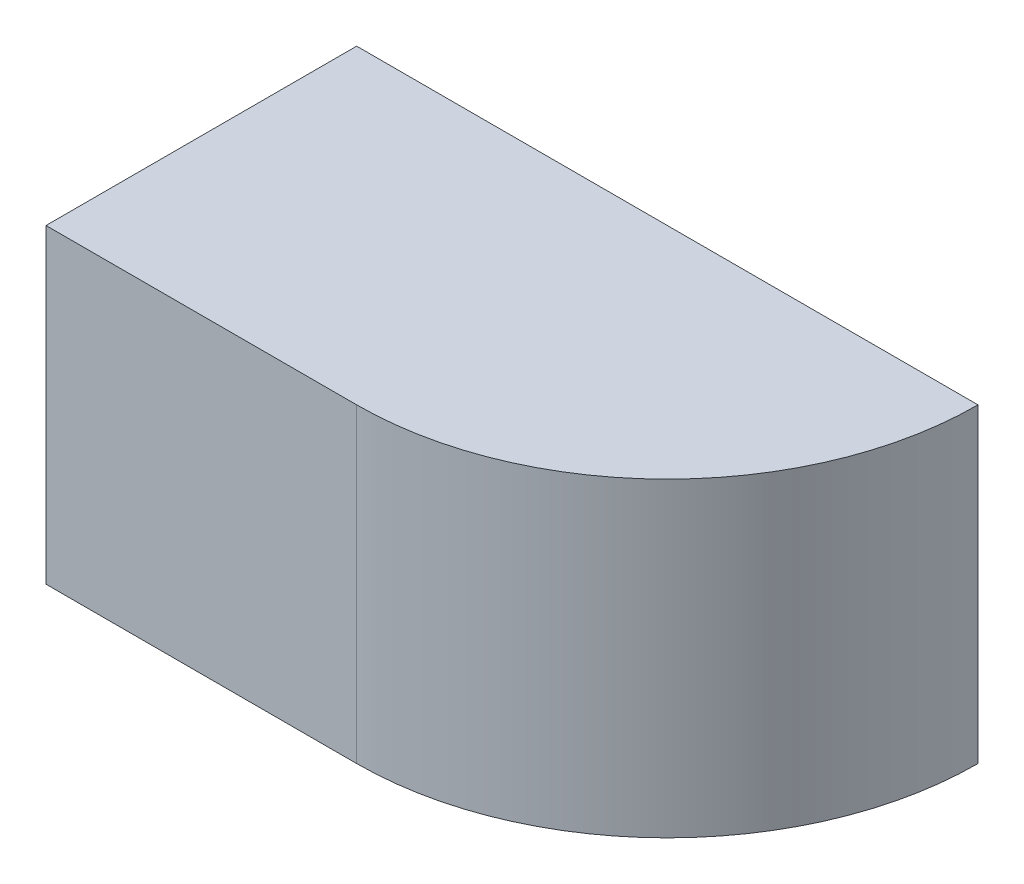
ISO-10303-21;
HEADER;
FILE_DESCRIPTION(('STEP AP214'),'2;1');
FILE_NAME('part.step','',(''),(''),'','','');
FILE_SCHEMA(('AUTOMOTIVE_DESIGN { 1 0 10303 214 1 1 1 1 }'));
ENDSEC;
DATA;
#1=APPLICATION_CONTEXT('core data for automotive mechanical design processes');
#2=APPLICATION_PROTOCOL_DEFINITION('international standard','automotive_design',2000,#1);
#3=PRODUCT_CONTEXT('',#1,'mechanical');
#4=PRODUCT('Part','Part','',(#3));
#5=PRODUCT_RELATED_PRODUCT_CATEGORY('part','',(#4));
#6=PRODUCT_DEFINITION_FORMATION('','',#4);
#7=PRODUCT_DEFINITION_CONTEXT('part definition',#1,'design');
#8=PRODUCT_DEFINITION('design','',#6,#7);
#9=PRODUCT_DEFINITION_SHAPE('','',#8);
#10=(LENGTH_UNIT() NAMED_UNIT(*) SI_UNIT(.MILLI.,.METRE.));
#11=(NAMED_UNIT(*) PLANE_ANGLE_UNIT() SI_UNIT($,.RADIAN.));
#12=(NAMED_UNIT(*) SI_UNIT($,.STERADIAN.) SOLID_ANGLE_UNIT());
#13=UNCERTAINTY_MEASURE_WITH_UNIT(LENGTH_MEASURE(1.E-05),#10,'distance_accuracy_value','');
#14=(GEOMETRIC_REPRESENTATION_CONTEXT(3) GLOBAL_UNCERTAINTY_ASSIGNED_CONTEXT((#13)) GLOBAL_UNIT_ASSIGNED_CONTEXT((#10,
#11,#12)) REPRESENTATION_CONTEXT('',''));
#15=CARTESIAN_POINT('',(0.,0.,0.));
#16=DIRECTION('',(0.,0.,1.));
#17=DIRECTION('',(1.,0.,0.));
#18=AXIS2_PLACEMENT_3D('',#15,#16,#17);
#19=CARTESIAN_POINT('',(2.00000002980232,-7.75000013038516,2.));
#20=DIRECTION('',(0.,0.,1.));
#21=DIRECTION('',(1.,0.,0.));
#22=AXIS2_PLACEMENT_3D('',#19,#20,#21);
#23=PLANE('',#22);
#24=DIRECTION('',(0.,-1.,0.));
#25=VECTOR('',#24,1.);
#26=CARTESIAN_POINT('',(1.50000002235174,-7.50000012665987,2.));
#27=LINE('',#26,#25);
#28=CARTESIAN_POINT('',(1.50000002235174,-7.50000012665987,2.));
#29=VERTEX_POINT('',#28);
#30=CARTESIAN_POINT('',(1.50000002235174,-8.00000013411045,2.));
#31=VERTEX_POINT('',#30);
#32=EDGE_CURVE('E11',#29,#31,#27,.T.);
#33=ORIENTED_EDGE('',*,*,#32,.F.);
#34=DIRECTION('',(-1.,0.,0.));
#35=VECTOR('',#34,1.);
#36=CARTESIAN_POINT('',(2.5000000372529,-7.50000012665987,2.));
#37=LINE('',#36,#35);
#38=CARTESIAN_POINT('',(2.5000000372529,-7.50000012665987,2.));
#39=VERTEX_POINT('',#38);
#40=EDGE_CURVE('E82',#39,#29,#37,.T.);
#41=ORIENTED_EDGE('',*,*,#40,.F.);
#42=DIRECTION('',(0.,1.,0.));
#43=VECTOR('',#42,1.);
#44=CARTESIAN_POINT('',(2.5000000372529,-8.00000013411045,2.));
#45=LINE('',#44,#43);
#46=CARTESIAN_POINT('',(2.5000000372529,-8.00000013411045,2.));
#47=VERTEX_POINT('',#46);
#48=EDGE_CURVE('E84',#47,#39,#45,.T.);
#49=ORIENTED_EDGE('',*,*,#48,.F.);
#50=DIRECTION('',(1.,0.,0.));
#51=VECTOR('',#50,1.);
#52=CARTESIAN_POINT('',(1.50000002235174,-8.00000013411045,2.));
#53=LINE('',#52,#51);
#54=EDGE_CURVE('E28',#31,#47,#53,.T.);
#55=ORIENTED_EDGE('',*,*,#54,.F.);
#56=EDGE_LOOP('',(#33,#41,#49,#55));
#57=FACE_BOUND('',#56,.T.);
#58=ADVANCED_FACE('F17',(#57),#23,.F.);
#59=CARTESIAN_POINT('',(1.50000002235174,-7.50000012665987,2.));
#60=DIRECTION('',(-1.,0.,0.));
#61=DIRECTION('',(0.,0.,1.));
#62=AXIS2_PLACEMENT_3D('',#59,#60,#61);
#63=PLANE('',#62);
#64=ORIENTED_EDGE('',*,*,#32,.T.);
#65=DIRECTION('',(0.,0.,1.));
#66=VECTOR('',#65,1.);
#67=CARTESIAN_POINT('',(1.50000002235174,-8.00000013411045,2.));
#68=LINE('',#67,#66);
#69=CARTESIAN_POINT('',(1.50000002235174,-8.00000013411045,2.5));
#70=VERTEX_POINT('',#69);
#71=EDGE_CURVE('E112',#31,#70,#68,.T.);
#72=ORIENTED_EDGE('',*,*,#71,.T.);
#73=DIRECTION('',(0.,-1.,0.));
#74=VECTOR('',#73,1.);
#75=CARTESIAN_POINT('',(1.50000002235174,-7.50000012665987,2.5));
#76=LINE('',#75,#74);
#77=CARTESIAN_POINT('',(1.50000002235174,-7.50000012665987,2.5));
#78=VERTEX_POINT('',#77);
#79=EDGE_CURVE('E117',#78,#70,#76,.T.);
#80=ORIENTED_EDGE('',*,*,#79,.F.);
#81=DIRECTION('',(0.,0.,1.));
#82=VECTOR('',#81,1.);
#83=CARTESIAN_POINT('',(1.50000002235174,-7.50000012665987,2.));
#84=LINE('',#83,#82);
#85=EDGE_CURVE('E87',#29,#78,#84,.T.);
#86=ORIENTED_EDGE('',*,*,#85,.F.);
#87=EDGE_LOOP('',(#64,#72,#80,#86));
#88=FACE_BOUND('',#87,.T.);
#89=ADVANCED_FACE('F19',(#88),#63,.T.);
#90=CARTESIAN_POINT('',(1.50000002235174,-8.00000013411045,2.));
#91=DIRECTION('',(0.,-1.,0.));
#92=DIRECTION('',(0.,0.,-1.));
#93=AXIS2_PLACEMENT_3D('',#90,#91,#92);
#94=PLANE('',#93);
#95=CARTESIAN_POINT('',(2.0000000372529,-8.00000013411045,2.));
#96=DIRECTION('',(0.,1.,0.));
#97=DIRECTION('',(0.707106781186548,0.,0.707106781186548));
#98=AXIS2_PLACEMENT_3D('',#95,#96,#97);
#99=CIRCLE('',#98,0.5);
#100=CARTESIAN_POINT('',(2.0000000372529,-8.00000013411045,2.5));
#101=VERTEX_POINT('',#100);
#102=EDGE_CURVE('E93',#101,#47,#99,.T.);
#103=ORIENTED_EDGE('',*,*,#102,.F.);
#104=DIRECTION('',(1.,0.,0.));
#105=VECTOR('',#104,1.);
#106=CARTESIAN_POINT('',(1.50000002235174,-8.00000013411045,2.5));
#107=LINE('',#106,#105);
#108=EDGE_CURVE('E67',#70,#101,#107,.T.);
#109=ORIENTED_EDGE('',*,*,#108,.F.);
#110=ORIENTED_EDGE('',*,*,#71,.F.);
#111=ORIENTED_EDGE('',*,*,#54,.T.);
#112=EDGE_LOOP('',(#103,#109,#110,#111));
#113=FACE_BOUND('',#112,.T.);
#114=ADVANCED_FACE('F121',(#113),#94,.T.);
#115=CARTESIAN_POINT('',(2.5000000372529,-7.50000012665987,2.));
#116=DIRECTION('',(0.,1.,0.));
#117=DIRECTION('',(1.,0.,0.));
#118=AXIS2_PLACEMENT_3D('',#115,#116,#117);
#119=PLANE('',#118);
#120=CARTESIAN_POINT('',(2.0000000372529,-7.50000012665987,2.));
#121=DIRECTION('',(0.,-1.,0.));
#122=DIRECTION('',(0.707106781186548,0.,0.707106781186548));
#123=AXIS2_PLACEMENT_3D('',#120,#121,#122);
#124=CIRCLE('',#123,0.5);
#125=CARTESIAN_POINT('',(2.0000000372529,-7.50000012665987,2.5));
#126=VERTEX_POINT('',#125);
#127=EDGE_CURVE('E21',#39,#126,#124,.T.);
#128=ORIENTED_EDGE('',*,*,#127,.F.);
#129=ORIENTED_EDGE('',*,*,#40,.T.);
#130=ORIENTED_EDGE('',*,*,#85,.T.);
#131=DIRECTION('',(-1.,0.,0.));
#132=VECTOR('',#131,1.);
#133=CARTESIAN_POINT('',(2.5000000372529,-7.50000012665987,2.5));
#134=LINE('',#133,#132);
#135=EDGE_CURVE('E76',#126,#78,#134,.T.);
#136=ORIENTED_EDGE('',*,*,#135,.F.);
#137=EDGE_LOOP('',(#128,#129,#130,#136));
#138=FACE_BOUND('',#137,.T.);
#139=ADVANCED_FACE('F96',(#138),#119,.T.);
#140=CARTESIAN_POINT('',(2.00000002980232,-7.75000013038516,2.5));
#141=DIRECTION('',(0.,0.,1.));
#142=DIRECTION('',(1.,0.,0.));
#143=AXIS2_PLACEMENT_3D('',#140,#141,#142);
#144=PLANE('',#143);
#145=DIRECTION('',(0.,-1.,0.));
#146=VECTOR('',#145,1.);
#147=CARTESIAN_POINT('',(2.0000000372529,-7.87500013224781,2.5));
#148=LINE('',#147,#146);
#149=EDGE_CURVE('E98',#126,#101,#148,.T.);
#150=ORIENTED_EDGE('',*,*,#149,.F.);
#151=ORIENTED_EDGE('',*,*,#135,.T.);
#152=ORIENTED_EDGE('',*,*,#79,.T.);
#153=ORIENTED_EDGE('',*,*,#108,.T.);
#154=EDGE_LOOP('',(#150,#151,#152,#153));
#155=FACE_BOUND('',#154,.T.);
#156=ADVANCED_FACE('F122',(#155),#144,.T.);
#157=CARTESIAN_POINT('',(2.0000000372529,-7.87500013224781,2.));
#158=DIRECTION('',(0.,1.,0.));
#159=DIRECTION('',(0.707106781186548,0.,0.707106781186548));
#160=AXIS2_PLACEMENT_3D('',#157,#158,#159);
#161=CYLINDRICAL_SURFACE('',#160,0.5);
#162=ORIENTED_EDGE('',*,*,#127,.T.);
#163=ORIENTED_EDGE('',*,*,#149,.T.);
#164=ORIENTED_EDGE('',*,*,#102,.T.);
#165=ORIENTED_EDGE('',*,*,#48,.T.);
#166=EDGE_LOOP('',(#162,#163,#164,#165));
#167=FACE_BOUND('',#166,.T.);
#168=ADVANCED_FACE('F91',(#167),#161,.T.);
#169=CLOSED_SHELL('',(#58,#89,#114,#139,#156,#168));
#170=MANIFOLD_SOLID_BREP('B1',#169);
#171=ADVANCED_BREP_SHAPE_REPRESENTATION('',(#18,#170),#14);
#172=SHAPE_DEFINITION_REPRESENTATION(#9,#171);
ENDSEC;
END-ISO-10303-21;
